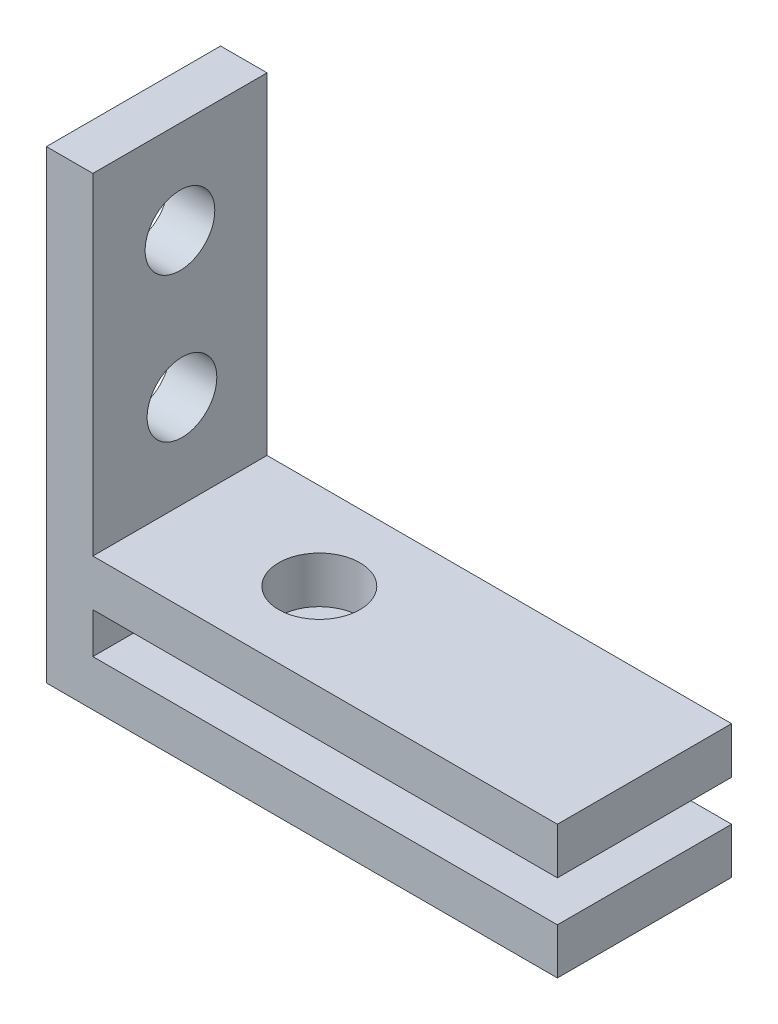
ISO-10303-21;
HEADER;
FILE_DESCRIPTION(('STEP AP214'),'2;1');
FILE_NAME('part.step','',(''),(''),'','','');
FILE_SCHEMA(('AUTOMOTIVE_DESIGN { 1 0 10303 214 1 1 1 1 }'));
ENDSEC;
DATA;
#1=APPLICATION_CONTEXT('core data for automotive mechanical design processes');
#2=APPLICATION_PROTOCOL_DEFINITION('international standard','automotive_design',2000,#1);
#3=PRODUCT_CONTEXT('',#1,'mechanical');
#4=PRODUCT('Part','Part','',(#3));
#5=PRODUCT_RELATED_PRODUCT_CATEGORY('part','',(#4));
#6=PRODUCT_DEFINITION_FORMATION('','',#4);
#7=PRODUCT_DEFINITION_CONTEXT('part definition',#1,'design');
#8=PRODUCT_DEFINITION('design','',#6,#7);
#9=PRODUCT_DEFINITION_SHAPE('','',#8);
#10=(LENGTH_UNIT() NAMED_UNIT(*) SI_UNIT(.MILLI.,.METRE.));
#11=(NAMED_UNIT(*) PLANE_ANGLE_UNIT() SI_UNIT($,.RADIAN.));
#12=(NAMED_UNIT(*) SI_UNIT($,.STERADIAN.) SOLID_ANGLE_UNIT());
#13=UNCERTAINTY_MEASURE_WITH_UNIT(LENGTH_MEASURE(1.E-05),#10,'distance_accuracy_value','');
#14=(GEOMETRIC_REPRESENTATION_CONTEXT(3) GLOBAL_UNCERTAINTY_ASSIGNED_CONTEXT((#13)) GLOBAL_UNIT_ASSIGNED_CONTEXT((#10,
#11,#12)) REPRESENTATION_CONTEXT('',''));
#15=CARTESIAN_POINT('',(0.,0.,0.));
#16=DIRECTION('',(0.,0.,1.));
#17=DIRECTION('',(1.,0.,0.));
#18=AXIS2_PLACEMENT_3D('',#15,#16,#17);
#19=CARTESIAN_POINT('',(2.,0.,0.));
#20=DIRECTION('',(1.,0.,0.));
#21=DIRECTION('',(0.,0.,-1.));
#22=AXIS2_PLACEMENT_3D('',#19,#20,#21);
#23=PLANE('',#22);
#24=DIRECTION('',(0.,1.,0.));
#25=VECTOR('',#24,1.);
#26=CARTESIAN_POINT('',(2.,9.02439024390244,-6.7595818815331));
#27=LINE('',#26,#25);
#28=CARTESIAN_POINT('',(2.,-8.99213043612717,-6.7595818815331));
#29=VERTEX_POINT('',#28);
#30=CARTESIAN_POINT('',(2.,-7.24213043612718,-6.7595818815331));
#31=VERTEX_POINT('',#30);
#32=EDGE_CURVE('E205',#29,#31,#27,.T.);
#33=ORIENTED_EDGE('',*,*,#32,.T.);
#34=DIRECTION('',(0.,0.,-1.));
#35=VECTOR('',#34,1.);
#36=CARTESIAN_POINT('',(2.,-7.24213043612717,0.));
#37=LINE('',#36,#35);
#38=CARTESIAN_POINT('',(2.,-7.24213043612718,0.740418118466897));
#39=VERTEX_POINT('',#38);
#40=EDGE_CURVE('E62',#39,#31,#37,.T.);
#41=ORIENTED_EDGE('',*,*,#40,.F.);
#42=DIRECTION('',(0.,-1.,0.));
#43=VECTOR('',#42,1.);
#44=CARTESIAN_POINT('',(2.,9.02439024390244,0.740418118466899));
#45=LINE('',#44,#43);
#46=CARTESIAN_POINT('',(2.,-8.99213043612717,0.740418118466897));
#47=VERTEX_POINT('',#46);
#48=EDGE_CURVE('E204',#39,#47,#45,.T.);
#49=ORIENTED_EDGE('',*,*,#48,.T.);
#50=DIRECTION('',(0.,0.,1.));
#51=VECTOR('',#50,1.);
#52=CARTESIAN_POINT('',(2.,-8.99213043612717,-6.7595818815331));
#53=LINE('',#52,#51);
#54=EDGE_CURVE('E134',#29,#47,#53,.T.);
#55=ORIENTED_EDGE('',*,*,#54,.F.);
#56=EDGE_LOOP('',(#33,#41,#49,#55));
#57=FACE_BOUND('',#56,.T.);
#58=ADVANCED_FACE('F44',(#57),#23,.T.);
#59=CARTESIAN_POINT('',(2.,9.02439024390244,0.740418118466899));
#60=DIRECTION('',(0.,0.,-1.));
#61=DIRECTION('',(0.,1.,0.));
#62=AXIS2_PLACEMENT_3D('',#59,#60,#61);
#63=PLANE('',#62);
#64=DIRECTION('',(0.,-1.,0.));
#65=VECTOR('',#64,1.);
#66=CARTESIAN_POINT('',(0.,9.02439024390244,0.740418118466899));
#67=LINE('',#66,#65);
#68=CARTESIAN_POINT('',(0.,9.02439024390244,0.740418118466899));
#69=VERTEX_POINT('',#68);
#70=CARTESIAN_POINT('',(0.,-10.9756097560976,0.740418118466897));
#71=VERTEX_POINT('',#70);
#72=EDGE_CURVE('E200',#69,#71,#67,.T.);
#73=ORIENTED_EDGE('',*,*,#72,.T.);
#74=DIRECTION('',(-1.,0.,0.));
#75=VECTOR('',#74,1.);
#76=CARTESIAN_POINT('',(2.,-10.9756097560976,0.740418118466897));
#77=LINE('',#76,#75);
#78=CARTESIAN_POINT('',(22.,-10.9756097560976,0.740418118466897));
#79=VERTEX_POINT('',#78);
#80=EDGE_CURVE('E11',#79,#71,#77,.T.);
#81=ORIENTED_EDGE('',*,*,#80,.F.);
#82=DIRECTION('',(0.,-1.,0.));
#83=VECTOR('',#82,1.);
#84=CARTESIAN_POINT('',(22.,-10.9756097560976,0.740418118466897));
#85=LINE('',#84,#83);
#86=CARTESIAN_POINT('',(22.,-8.99213043612717,0.740418118466897));
#87=VERTEX_POINT('',#86);
#88=EDGE_CURVE('E181',#87,#79,#85,.T.);
#89=ORIENTED_EDGE('',*,*,#88,.F.);
#90=DIRECTION('',(-1.,0.,0.));
#91=VECTOR('',#90,1.);
#92=CARTESIAN_POINT('',(22.,-8.99213043612717,0.740418118466897));
#93=LINE('',#92,#91);
#94=EDGE_CURVE('E189',#87,#47,#93,.T.);
#95=ORIENTED_EDGE('',*,*,#94,.T.);
#96=ORIENTED_EDGE('',*,*,#48,.F.);
#97=DIRECTION('',(-1.,0.,0.));
#98=VECTOR('',#97,1.);
#99=CARTESIAN_POINT('',(22.,-7.24213043612717,0.740418118466897));
#100=LINE('',#99,#98);
#101=CARTESIAN_POINT('',(22.,-7.24213043612717,0.740418118466897));
#102=VERTEX_POINT('',#101);
#103=EDGE_CURVE('E135',#102,#39,#100,.T.);
#104=ORIENTED_EDGE('',*,*,#103,.F.);
#105=DIRECTION('',(0.,-1.,0.));
#106=VECTOR('',#105,1.);
#107=CARTESIAN_POINT('',(22.,0.,0.740418118466898));
#108=LINE('',#107,#106);
#109=CARTESIAN_POINT('',(22.,-5.24213043612717,0.740418118466897));
#110=VERTEX_POINT('',#109);
#111=EDGE_CURVE('E138',#110,#102,#108,.T.);
#112=ORIENTED_EDGE('',*,*,#111,.F.);
#113=DIRECTION('',(-1.,0.,0.));
#114=VECTOR('',#113,1.);
#115=CARTESIAN_POINT('',(22.,-5.24213043612717,0.740418118466897));
#116=LINE('',#115,#114);
#117=CARTESIAN_POINT('',(2.,-5.24213043612717,0.740418118466897));
#118=VERTEX_POINT('',#117);
#119=EDGE_CURVE('E125',#110,#118,#116,.T.);
#120=ORIENTED_EDGE('',*,*,#119,.T.);
#121=CARTESIAN_POINT('',(2.,9.02439024390244,0.740418118466899));
#122=VERTEX_POINT('',#121);
#123=EDGE_CURVE('E70',#122,#118,#45,.T.);
#124=ORIENTED_EDGE('',*,*,#123,.F.);
#125=DIRECTION('',(-1.,0.,0.));
#126=VECTOR('',#125,1.);
#127=CARTESIAN_POINT('',(2.,9.02439024390244,0.740418118466899));
#128=LINE('',#127,#126);
#129=EDGE_CURVE('E211',#122,#69,#128,.T.);
#130=ORIENTED_EDGE('',*,*,#129,.T.);
#131=EDGE_LOOP('',(#73,#81,#89,#95,#96,#104,#112,#120,#124,#130));
#132=FACE_BOUND('',#131,.T.);
#133=ADVANCED_FACE('F46',(#132),#63,.F.);
#134=CARTESIAN_POINT('',(2.,-10.9756097560976,0.740418118466897));
#135=DIRECTION('',(0.,1.,0.));
#136=DIRECTION('',(0.,0.,1.));
#137=AXIS2_PLACEMENT_3D('',#134,#135,#136);
#138=PLANE('',#137);
#139=CARTESIAN_POINT('',(8.,-10.9756097560976,-3.0095818815331));
#140=DIRECTION('',(0.,1.,0.));
#141=DIRECTION('',(0.,0.,1.));
#142=AXIS2_PLACEMENT_3D('',#139,#140,#141);
#143=CIRCLE('',#142,1.75);
#144=CARTESIAN_POINT('',(8.,-10.9756097560976,-1.2595818815331));
#145=VERTEX_POINT('',#144);
#146=EDGE_CURVE('E329',#145,#145,#143,.T.);
#147=ORIENTED_EDGE('',*,*,#146,.T.);
#148=EDGE_LOOP('',(#147));
#149=FACE_BOUND('',#148,.T.);
#150=DIRECTION('',(0.,0.,-1.));
#151=VECTOR('',#150,1.);
#152=CARTESIAN_POINT('',(0.,-10.9756097560976,0.740418118466897));
#153=LINE('',#152,#151);
#154=CARTESIAN_POINT('',(0.,-10.9756097560976,-6.7595818815331));
#155=VERTEX_POINT('',#154);
#156=EDGE_CURVE('E214',#71,#155,#153,.T.);
#157=ORIENTED_EDGE('',*,*,#156,.T.);
#158=DIRECTION('',(-1.,0.,0.));
#159=VECTOR('',#158,1.);
#160=CARTESIAN_POINT('',(2.,-10.9756097560976,-6.7595818815331));
#161=LINE('',#160,#159);
#162=CARTESIAN_POINT('',(22.,-10.9756097560976,-6.7595818815331));
#163=VERTEX_POINT('',#162);
#164=EDGE_CURVE('E54',#163,#155,#161,.T.);
#165=ORIENTED_EDGE('',*,*,#164,.F.);
#166=DIRECTION('',(0.,0.,-1.));
#167=VECTOR('',#166,1.);
#168=CARTESIAN_POINT('',(22.,-10.9756097560976,-6.7595818815331));
#169=LINE('',#168,#167);
#170=EDGE_CURVE('E185',#79,#163,#169,.T.);
#171=ORIENTED_EDGE('',*,*,#170,.F.);
#172=ORIENTED_EDGE('',*,*,#80,.T.);
#173=EDGE_LOOP('',(#157,#165,#171,#172));
#174=FACE_BOUND('',#173,.T.);
#175=ADVANCED_FACE('F266',(#149,#174),#138,.F.);
#176=CARTESIAN_POINT('',(2.,9.02439024390244,-6.7595818815331));
#177=DIRECTION('',(0.,0.,1.));
#178=DIRECTION('',(1.,0.,0.));
#179=AXIS2_PLACEMENT_3D('',#176,#177,#178);
#180=PLANE('',#179);
#181=DIRECTION('',(0.,1.,0.));
#182=VECTOR('',#181,1.);
#183=CARTESIAN_POINT('',(0.,9.02439024390244,-6.7595818815331));
#184=LINE('',#183,#182);
#185=CARTESIAN_POINT('',(0.,9.02439024390244,-6.7595818815331));
#186=VERTEX_POINT('',#185);
#187=EDGE_CURVE('E217',#155,#186,#184,.T.);
#188=ORIENTED_EDGE('',*,*,#187,.T.);
#189=DIRECTION('',(-1.,0.,0.));
#190=VECTOR('',#189,1.);
#191=CARTESIAN_POINT('',(2.,9.02439024390244,-6.7595818815331));
#192=LINE('',#191,#190);
#193=CARTESIAN_POINT('',(2.,9.02439024390244,-6.7595818815331));
#194=VERTEX_POINT('',#193);
#195=EDGE_CURVE('E226',#194,#186,#192,.T.);
#196=ORIENTED_EDGE('',*,*,#195,.F.);
#197=CARTESIAN_POINT('',(2.,-5.24213043612717,-6.7595818815331));
#198=VERTEX_POINT('',#197);
#199=EDGE_CURVE('E203',#198,#194,#27,.T.);
#200=ORIENTED_EDGE('',*,*,#199,.F.);
#201=DIRECTION('',(-1.,0.,0.));
#202=VECTOR('',#201,1.);
#203=CARTESIAN_POINT('',(22.,-5.24213043612717,-6.7595818815331));
#204=LINE('',#203,#202);
#205=CARTESIAN_POINT('',(22.,-5.24213043612717,-6.7595818815331));
#206=VERTEX_POINT('',#205);
#207=EDGE_CURVE('E162',#206,#198,#204,.T.);
#208=ORIENTED_EDGE('',*,*,#207,.F.);
#209=DIRECTION('',(0.,1.,0.));
#210=VECTOR('',#209,1.);
#211=CARTESIAN_POINT('',(22.,0.,-6.7595818815331));
#212=LINE('',#211,#210);
#213=CARTESIAN_POINT('',(22.,-7.24213043612717,-6.7595818815331));
#214=VERTEX_POINT('',#213);
#215=EDGE_CURVE('E148',#214,#206,#212,.T.);
#216=ORIENTED_EDGE('',*,*,#215,.F.);
#217=DIRECTION('',(-1.,0.,0.));
#218=VECTOR('',#217,1.);
#219=CARTESIAN_POINT('',(22.,-7.24213043612717,-6.7595818815331));
#220=LINE('',#219,#218);
#221=EDGE_CURVE('E168',#214,#31,#220,.T.);
#222=ORIENTED_EDGE('',*,*,#221,.T.);
#223=ORIENTED_EDGE('',*,*,#32,.F.);
#224=DIRECTION('',(-1.,0.,0.));
#225=VECTOR('',#224,1.);
#226=CARTESIAN_POINT('',(22.,-8.99213043612717,-6.7595818815331));
#227=LINE('',#226,#225);
#228=CARTESIAN_POINT('',(22.,-8.99213043612717,-6.7595818815331));
#229=VERTEX_POINT('',#228);
#230=EDGE_CURVE('E196',#229,#29,#227,.T.);
#231=ORIENTED_EDGE('',*,*,#230,.F.);
#232=DIRECTION('',(0.,1.,0.));
#233=VECTOR('',#232,1.);
#234=CARTESIAN_POINT('',(22.,-10.9756097560976,-6.7595818815331));
#235=LINE('',#234,#233);
#236=EDGE_CURVE('E174',#163,#229,#235,.T.);
#237=ORIENTED_EDGE('',*,*,#236,.F.);
#238=ORIENTED_EDGE('',*,*,#164,.T.);
#239=EDGE_LOOP('',(#188,#196,#200,#208,#216,#222,#223,#231,#237,#238));
#240=FACE_BOUND('',#239,.T.);
#241=ADVANCED_FACE('F277',(#240),#180,.F.);
#242=CARTESIAN_POINT('',(2.,9.02439024390244,0.740418118466899));
#243=DIRECTION('',(0.,-1.,0.));
#244=DIRECTION('',(0.,0.,-1.));
#245=AXIS2_PLACEMENT_3D('',#242,#243,#244);
#246=PLANE('',#245);
#247=DIRECTION('',(0.,0.,1.));
#248=VECTOR('',#247,1.);
#249=CARTESIAN_POINT('',(0.,9.02439024390244,0.740418118466899));
#250=LINE('',#249,#248);
#251=EDGE_CURVE('E220',#186,#69,#250,.T.);
#252=ORIENTED_EDGE('',*,*,#251,.T.);
#253=ORIENTED_EDGE('',*,*,#129,.F.);
#254=DIRECTION('',(0.,0.,1.));
#255=VECTOR('',#254,1.);
#256=CARTESIAN_POINT('',(2.,9.02439024390244,0.740418118466899));
#257=LINE('',#256,#255);
#258=EDGE_CURVE('E208',#194,#122,#257,.T.);
#259=ORIENTED_EDGE('',*,*,#258,.F.);
#260=ORIENTED_EDGE('',*,*,#195,.T.);
#261=EDGE_LOOP('',(#252,#253,#259,#260));
#262=FACE_BOUND('',#261,.T.);
#263=ADVANCED_FACE('F270',(#262),#246,.F.);
#264=CARTESIAN_POINT('',(2.,5.02439024390244,-3.0095818815331));
#265=DIRECTION('',(1.,0.,0.));
#266=DIRECTION('',(0.,0.,-1.));
#267=AXIS2_PLACEMENT_3D('',#264,#265,#266);
#268=CIRCLE('',#267,1.5);
#269=CARTESIAN_POINT('',(2.,5.02439024390244,-4.5095818815331));
#270=VERTEX_POINT('',#269);
#271=EDGE_CURVE('E236',#270,#270,#268,.T.);
#272=ORIENTED_EDGE('',*,*,#271,.F.);
#273=EDGE_LOOP('',(#272));
#274=FACE_BOUND('',#273,.T.);
#275=CARTESIAN_POINT('',(2.,-1.24213043612717,-3.09645831879379));
#276=DIRECTION('',(1.,0.,0.));
#277=DIRECTION('',(0.,0.,-1.));
#278=AXIS2_PLACEMENT_3D('',#275,#276,#277);
#279=CIRCLE('',#278,1.5);
#280=CARTESIAN_POINT('',(2.,-1.24213043612717,-4.59645831879379));
#281=VERTEX_POINT('',#280);
#282=EDGE_CURVE('E155',#281,#281,#279,.T.);
#283=ORIENTED_EDGE('',*,*,#282,.F.);
#284=EDGE_LOOP('',(#283));
#285=FACE_BOUND('',#284,.T.);
#286=DIRECTION('',(0.,0.,-1.));
#287=VECTOR('',#286,1.);
#288=CARTESIAN_POINT('',(2.,-5.24213043612717,0.));
#289=LINE('',#288,#287);
#290=EDGE_CURVE('E131',#118,#198,#289,.T.);
#291=ORIENTED_EDGE('',*,*,#290,.T.);
#292=ORIENTED_EDGE('',*,*,#199,.T.);
#293=ORIENTED_EDGE('',*,*,#258,.T.);
#294=ORIENTED_EDGE('',*,*,#123,.T.);
#295=EDGE_LOOP('',(#291,#292,#293,#294));
#296=FACE_BOUND('',#295,.T.);
#297=ADVANCED_FACE('F262',(#274,#285,#296),#23,.T.);
#298=CARTESIAN_POINT('',(0.,0.,0.));
#299=DIRECTION('',(1.,0.,0.));
#300=DIRECTION('',(0.,0.,-1.));
#301=AXIS2_PLACEMENT_3D('',#298,#299,#300);
#302=PLANE('',#301);
#303=CARTESIAN_POINT('',(0.,5.02439024390244,-3.0095818815331));
#304=DIRECTION('',(1.,0.,0.));
#305=DIRECTION('',(0.,0.,-1.));
#306=AXIS2_PLACEMENT_3D('',#303,#304,#305);
#307=CIRCLE('',#306,1.5);
#308=CARTESIAN_POINT('',(0.,5.02439024390244,-4.5095818815331));
#309=VERTEX_POINT('',#308);
#310=EDGE_CURVE('E164',#309,#309,#307,.T.);
#311=ORIENTED_EDGE('',*,*,#310,.T.);
#312=EDGE_LOOP('',(#311));
#313=FACE_BOUND('',#312,.T.);
#314=CARTESIAN_POINT('',(0.,-1.24213043612717,-3.09645831879379));
#315=DIRECTION('',(1.,0.,0.));
#316=DIRECTION('',(0.,0.,-1.));
#317=AXIS2_PLACEMENT_3D('',#314,#315,#316);
#318=CIRCLE('',#317,1.5);
#319=CARTESIAN_POINT('',(0.,-1.24213043612717,-4.59645831879379));
#320=VERTEX_POINT('',#319);
#321=EDGE_CURVE('E233',#320,#320,#318,.T.);
#322=ORIENTED_EDGE('',*,*,#321,.T.);
#323=EDGE_LOOP('',(#322));
#324=FACE_BOUND('',#323,.T.);
#325=ORIENTED_EDGE('',*,*,#72,.F.);
#326=ORIENTED_EDGE('',*,*,#251,.F.);
#327=ORIENTED_EDGE('',*,*,#187,.F.);
#328=ORIENTED_EDGE('',*,*,#156,.F.);
#329=EDGE_LOOP('',(#325,#326,#327,#328));
#330=FACE_BOUND('',#329,.T.);
#331=ADVANCED_FACE('F241',(#313,#324,#330),#302,.F.);
#332=CARTESIAN_POINT('',(22.,-8.99213043612717,-6.7595818815331));
#333=DIRECTION('',(0.,-1.,0.));
#334=DIRECTION('',(0.,0.,-1.));
#335=AXIS2_PLACEMENT_3D('',#332,#333,#334);
#336=PLANE('',#335);
#337=CARTESIAN_POINT('',(8.,-8.99213043612717,-3.0095818815331));
#338=DIRECTION('',(0.,-1.,0.));
#339=DIRECTION('',(0.,0.,-1.));
#340=AXIS2_PLACEMENT_3D('',#337,#338,#339);
#341=CIRCLE('',#340,1.75);
#342=CARTESIAN_POINT('',(8.,-8.99213043612717,-4.7595818815331));
#343=VERTEX_POINT('',#342);
#344=EDGE_CURVE('E326',#343,#343,#341,.T.);
#345=ORIENTED_EDGE('',*,*,#344,.T.);
#346=EDGE_LOOP('',(#345));
#347=FACE_BOUND('',#346,.T.);
#348=ORIENTED_EDGE('',*,*,#54,.T.);
#349=ORIENTED_EDGE('',*,*,#94,.F.);
#350=DIRECTION('',(0.,0.,1.));
#351=VECTOR('',#350,1.);
#352=CARTESIAN_POINT('',(22.,-8.99213043612717,-6.7595818815331));
#353=LINE('',#352,#351);
#354=EDGE_CURVE('E178',#229,#87,#353,.T.);
#355=ORIENTED_EDGE('',*,*,#354,.F.);
#356=ORIENTED_EDGE('',*,*,#230,.T.);
#357=EDGE_LOOP('',(#348,#349,#355,#356));
#358=FACE_BOUND('',#357,.T.);
#359=ADVANCED_FACE('F276',(#347,#358),#336,.F.);
#360=CARTESIAN_POINT('',(22.,0.,0.));
#361=DIRECTION('',(1.,0.,0.));
#362=DIRECTION('',(0.,0.,-1.));
#363=AXIS2_PLACEMENT_3D('',#360,#361,#362);
#364=PLANE('',#363);
#365=ORIENTED_EDGE('',*,*,#236,.T.);
#366=ORIENTED_EDGE('',*,*,#354,.T.);
#367=ORIENTED_EDGE('',*,*,#88,.T.);
#368=ORIENTED_EDGE('',*,*,#170,.T.);
#369=EDGE_LOOP('',(#365,#366,#367,#368));
#370=FACE_BOUND('',#369,.T.);
#371=ADVANCED_FACE('F296',(#370),#364,.T.);
#372=CARTESIAN_POINT('',(22.,-5.24213043612717,0.));
#373=DIRECTION('',(0.,1.,0.));
#374=DIRECTION('',(0.,0.,1.));
#375=AXIS2_PLACEMENT_3D('',#372,#373,#374);
#376=PLANE('',#375);
#377=CARTESIAN_POINT('',(8.,-5.24213043612717,-3.0095818815331));
#378=DIRECTION('',(0.,1.,0.));
#379=DIRECTION('',(0.,0.,1.));
#380=AXIS2_PLACEMENT_3D('',#377,#378,#379);
#381=CIRCLE('',#380,1.75);
#382=CARTESIAN_POINT('',(8.,-5.24213043612717,-1.2595818815331));
#383=VERTEX_POINT('',#382);
#384=EDGE_CURVE('E335',#383,#383,#381,.T.);
#385=ORIENTED_EDGE('',*,*,#384,.F.);
#386=EDGE_LOOP('',(#385));
#387=FACE_BOUND('',#386,.T.);
#388=ORIENTED_EDGE('',*,*,#290,.F.);
#389=ORIENTED_EDGE('',*,*,#119,.F.);
#390=DIRECTION('',(0.,0.,-1.));
#391=VECTOR('',#390,1.);
#392=CARTESIAN_POINT('',(22.,-5.24213043612717,0.));
#393=LINE('',#392,#391);
#394=EDGE_CURVE('E130',#110,#206,#393,.T.);
#395=ORIENTED_EDGE('',*,*,#394,.T.);
#396=ORIENTED_EDGE('',*,*,#207,.T.);
#397=EDGE_LOOP('',(#388,#389,#395,#396));
#398=FACE_BOUND('',#397,.T.);
#399=ADVANCED_FACE('F127',(#387,#398),#376,.T.);
#400=CARTESIAN_POINT('',(22.,-7.24213043612717,0.));
#401=DIRECTION('',(0.,1.,0.));
#402=DIRECTION('',(0.,0.,1.));
#403=AXIS2_PLACEMENT_3D('',#400,#401,#402);
#404=PLANE('',#403);
#405=CARTESIAN_POINT('',(8.,-7.24213043612717,-3.0095818815331));
#406=DIRECTION('',(0.,1.,0.));
#407=DIRECTION('',(0.,0.,1.));
#408=AXIS2_PLACEMENT_3D('',#405,#406,#407);
#409=CIRCLE('',#408,1.75);
#410=CARTESIAN_POINT('',(8.,-7.24213043612717,-1.2595818815331));
#411=VERTEX_POINT('',#410);
#412=EDGE_CURVE('E48',#411,#411,#409,.T.);
#413=ORIENTED_EDGE('',*,*,#412,.T.);
#414=EDGE_LOOP('',(#413));
#415=FACE_BOUND('',#414,.T.);
#416=ORIENTED_EDGE('',*,*,#40,.T.);
#417=ORIENTED_EDGE('',*,*,#221,.F.);
#418=DIRECTION('',(0.,0.,-1.));
#419=VECTOR('',#418,1.);
#420=CARTESIAN_POINT('',(22.,-7.24213043612717,0.));
#421=LINE('',#420,#419);
#422=EDGE_CURVE('E144',#102,#214,#421,.T.);
#423=ORIENTED_EDGE('',*,*,#422,.F.);
#424=ORIENTED_EDGE('',*,*,#103,.T.);
#425=EDGE_LOOP('',(#416,#417,#423,#424));
#426=FACE_BOUND('',#425,.T.);
#427=ADVANCED_FACE('F306',(#415,#426),#404,.F.);
#428=CARTESIAN_POINT('',(22.,0.,0.));
#429=DIRECTION('',(1.,0.,0.));
#430=DIRECTION('',(0.,0.,-1.));
#431=AXIS2_PLACEMENT_3D('',#428,#429,#430);
#432=PLANE('',#431);
#433=ORIENTED_EDGE('',*,*,#394,.F.);
#434=ORIENTED_EDGE('',*,*,#111,.T.);
#435=ORIENTED_EDGE('',*,*,#422,.T.);
#436=ORIENTED_EDGE('',*,*,#215,.T.);
#437=EDGE_LOOP('',(#433,#434,#435,#436));
#438=FACE_BOUND('',#437,.T.);
#439=ADVANCED_FACE('F146',(#438),#432,.T.);
#440=CARTESIAN_POINT('',(-18.,-1.24213043612717,-3.09645831879379));
#441=DIRECTION('',(1.,0.,0.));
#442=DIRECTION('',(0.,0.,-1.));
#443=AXIS2_PLACEMENT_3D('',#440,#441,#442);
#444=CYLINDRICAL_SURFACE('',#443,1.5);
#445=ORIENTED_EDGE('',*,*,#282,.T.);
#446=EDGE_LOOP('',(#445));
#447=FACE_BOUND('',#446,.T.);
#448=ORIENTED_EDGE('',*,*,#321,.F.);
#449=EDGE_LOOP('',(#448));
#450=FACE_BOUND('',#449,.T.);
#451=ADVANCED_FACE('F247',(#447,#450),#444,.F.);
#452=CARTESIAN_POINT('',(-18.,5.02439024390244,-3.0095818815331));
#453=DIRECTION('',(1.,0.,0.));
#454=DIRECTION('',(0.,0.,-1.));
#455=AXIS2_PLACEMENT_3D('',#452,#453,#454);
#456=CYLINDRICAL_SURFACE('',#455,1.5);
#457=ORIENTED_EDGE('',*,*,#271,.T.);
#458=EDGE_LOOP('',(#457));
#459=FACE_BOUND('',#458,.T.);
#460=ORIENTED_EDGE('',*,*,#310,.F.);
#461=EDGE_LOOP('',(#460));
#462=FACE_BOUND('',#461,.T.);
#463=ADVANCED_FACE('F244',(#459,#462),#456,.F.);
#464=CARTESIAN_POINT('',(8.,-15.2421304361272,-3.0095818815331));
#465=DIRECTION('',(0.,1.,0.));
#466=DIRECTION('',(0.,0.,1.));
#467=AXIS2_PLACEMENT_3D('',#464,#465,#466);
#468=CYLINDRICAL_SURFACE('',#467,1.75);
#469=ORIENTED_EDGE('',*,*,#384,.T.);
#470=EDGE_LOOP('',(#469));
#471=FACE_BOUND('',#470,.T.);
#472=ORIENTED_EDGE('',*,*,#412,.F.);
#473=EDGE_LOOP('',(#472));
#474=FACE_BOUND('',#473,.T.);
#475=ADVANCED_FACE('F246',(#471,#474),#468,.F.);
#476=ORIENTED_EDGE('',*,*,#344,.F.);
#477=EDGE_LOOP('',(#476));
#478=FACE_BOUND('',#477,.T.);
#479=ORIENTED_EDGE('',*,*,#146,.F.);
#480=EDGE_LOOP('',(#479));
#481=FACE_BOUND('',#480,.T.);
#482=ADVANCED_FACE('F254',(#478,#481),#468,.F.);
#483=CLOSED_SHELL('',(#58,#133,#175,#241,#263,#297,#331,#359,#371,#399,#427,#439,#451,#463,#475,#482));
#484=MANIFOLD_SOLID_BREP('B2',#483);
#485=ADVANCED_BREP_SHAPE_REPRESENTATION('',(#18,#484),#14);
#486=SHAPE_DEFINITION_REPRESENTATION(#9,#485);
ENDSEC;
END-ISO-10303-21;
